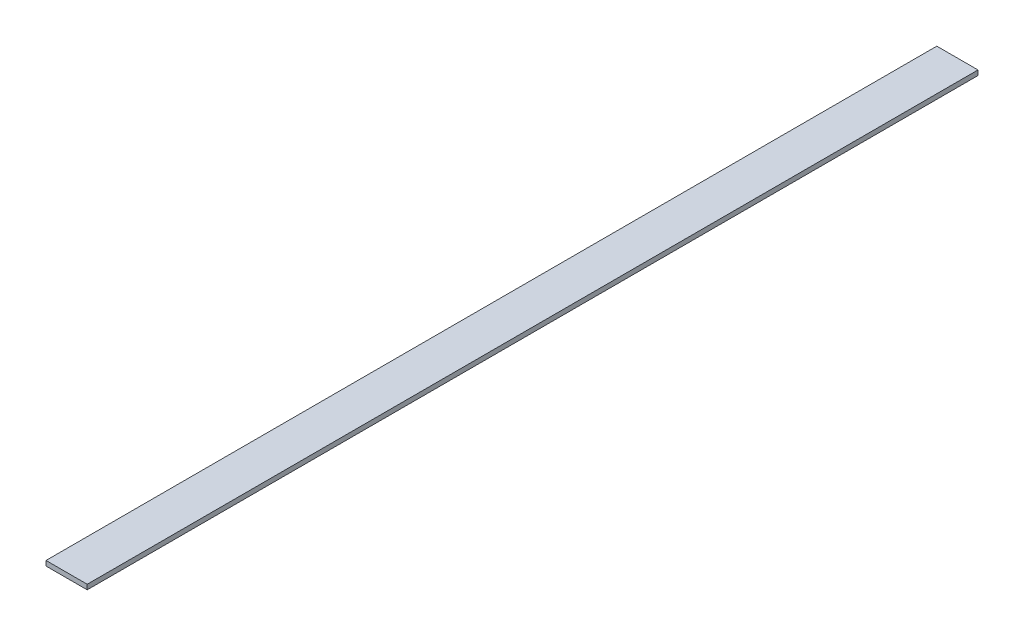
ISO-10303-21;
HEADER;
FILE_DESCRIPTION(('STEP AP214'),'2;1');
FILE_NAME('part.step','',(''),(''),'','','');
FILE_SCHEMA(('AUTOMOTIVE_DESIGN { 1 0 10303 214 1 1 1 1 }'));
ENDSEC;
DATA;
#1=APPLICATION_CONTEXT('core data for automotive mechanical design processes');
#2=APPLICATION_PROTOCOL_DEFINITION('international standard','automotive_design',2000,#1);
#3=PRODUCT_CONTEXT('',#1,'mechanical');
#4=PRODUCT('Part','Part','',(#3));
#5=PRODUCT_RELATED_PRODUCT_CATEGORY('part','',(#4));
#6=PRODUCT_DEFINITION_FORMATION('','',#4);
#7=PRODUCT_DEFINITION_CONTEXT('part definition',#1,'design');
#8=PRODUCT_DEFINITION('design','',#6,#7);
#9=PRODUCT_DEFINITION_SHAPE('','',#8);
#10=(LENGTH_UNIT() NAMED_UNIT(*) SI_UNIT(.MILLI.,.METRE.));
#11=(NAMED_UNIT(*) PLANE_ANGLE_UNIT() SI_UNIT($,.RADIAN.));
#12=(NAMED_UNIT(*) SI_UNIT($,.STERADIAN.) SOLID_ANGLE_UNIT());
#13=UNCERTAINTY_MEASURE_WITH_UNIT(LENGTH_MEASURE(1.E-05),#10,'distance_accuracy_value','');
#14=(GEOMETRIC_REPRESENTATION_CONTEXT(3) GLOBAL_UNCERTAINTY_ASSIGNED_CONTEXT((#13)) GLOBAL_UNIT_ASSIGNED_CONTEXT((#10,
#11,#12)) REPRESENTATION_CONTEXT('',''));
#15=CARTESIAN_POINT('',(0.,0.,0.));
#16=DIRECTION('',(0.,0.,1.));
#17=DIRECTION('',(1.,0.,0.));
#18=AXIS2_PLACEMENT_3D('',#15,#16,#17);
#19=CARTESIAN_POINT('',(-25.1001272406357,337.925662841851,503.882719675103));
#20=DIRECTION('',(-1.,0.,0.));
#21=DIRECTION('',(0.,0.,1.));
#22=AXIS2_PLACEMENT_3D('',#19,#20,#21);
#23=PLANE('',#22);
#24=DIRECTION('',(0.,0.,-1.));
#25=VECTOR('',#24,1.);
#26=CARTESIAN_POINT('',(-25.1001272406357,334.925662841851,503.882719675103));
#27=LINE('',#26,#25);
#28=CARTESIAN_POINT('',(-25.1001272406357,334.925662841851,503.882719675103));
#29=VERTEX_POINT('',#28);
#30=CARTESIAN_POINT('',(-25.1001272406357,334.925662841851,-45.3172803248968));
#31=VERTEX_POINT('',#30);
#32=EDGE_CURVE('E104',#29,#31,#27,.T.);
#33=ORIENTED_EDGE('',*,*,#32,.F.);
#34=DIRECTION('',(0.,-1.,0.));
#35=VECTOR('',#34,1.);
#36=CARTESIAN_POINT('',(-25.1001272406357,337.925662841851,503.882719675103));
#37=LINE('',#36,#35);
#38=CARTESIAN_POINT('',(-25.1001272406357,337.925662841851,503.882719675103));
#39=VERTEX_POINT('',#38);
#40=EDGE_CURVE('E11',#39,#29,#37,.T.);
#41=ORIENTED_EDGE('',*,*,#40,.F.);
#42=DIRECTION('',(0.,0.,-1.));
#43=VECTOR('',#42,1.);
#44=CARTESIAN_POINT('',(-25.1001272406357,337.925662841851,503.882719675103));
#45=LINE('',#44,#43);
#46=CARTESIAN_POINT('',(-25.1001272406357,337.925662841851,-45.3172803248968));
#47=VERTEX_POINT('',#46);
#48=EDGE_CURVE('E98',#39,#47,#45,.T.);
#49=ORIENTED_EDGE('',*,*,#48,.T.);
#50=DIRECTION('',(0.,-1.,0.));
#51=VECTOR('',#50,1.);
#52=CARTESIAN_POINT('',(-25.1001272406357,337.925662841851,-45.3172803248968));
#53=LINE('',#52,#51);
#54=EDGE_CURVE('E42',#47,#31,#53,.T.);
#55=ORIENTED_EDGE('',*,*,#54,.T.);
#56=EDGE_LOOP('',(#33,#41,#49,#55));
#57=FACE_BOUND('',#56,.T.);
#58=ADVANCED_FACE('F39',(#57),#23,.T.);
#59=CARTESIAN_POINT('',(-25.1001272406357,337.925662841851,503.882719675103));
#60=DIRECTION('',(0.,0.,-1.));
#61=DIRECTION('',(-1.,0.,0.));
#62=AXIS2_PLACEMENT_3D('',#59,#60,#61);
#63=PLANE('',#62);
#64=DIRECTION('',(1.,0.,0.));
#65=VECTOR('',#64,1.);
#66=CARTESIAN_POINT('',(-25.1001272406357,334.925662841851,503.882719675103));
#67=LINE('',#66,#65);
#68=CARTESIAN_POINT('',(0.299872759365239,334.925662841851,503.882719675103));
#69=VERTEX_POINT('',#68);
#70=EDGE_CURVE('E100',#29,#69,#67,.T.);
#71=ORIENTED_EDGE('',*,*,#70,.T.);
#72=DIRECTION('',(0.,-1.,0.));
#73=VECTOR('',#72,1.);
#74=CARTESIAN_POINT('',(0.299872759365239,337.925662841851,503.882719675103));
#75=LINE('',#74,#73);
#76=CARTESIAN_POINT('',(0.299872759365239,337.925662841851,503.882719675103));
#77=VERTEX_POINT('',#76);
#78=EDGE_CURVE('E48',#77,#69,#75,.T.);
#79=ORIENTED_EDGE('',*,*,#78,.F.);
#80=DIRECTION('',(1.,0.,0.));
#81=VECTOR('',#80,1.);
#82=CARTESIAN_POINT('',(-25.1001272406357,337.925662841851,503.882719675103));
#83=LINE('',#82,#81);
#84=EDGE_CURVE('E95',#39,#77,#83,.T.);
#85=ORIENTED_EDGE('',*,*,#84,.F.);
#86=ORIENTED_EDGE('',*,*,#40,.T.);
#87=EDGE_LOOP('',(#71,#79,#85,#86));
#88=FACE_BOUND('',#87,.T.);
#89=ADVANCED_FACE('F111',(#88),#63,.F.);
#90=CARTESIAN_POINT('',(0.299872759364018,337.925662841851,-45.3172803248968));
#91=DIRECTION('',(1.,0.,0.));
#92=DIRECTION('',(0.,0.,-1.));
#93=AXIS2_PLACEMENT_3D('',#90,#91,#92);
#94=PLANE('',#93);
#95=DIRECTION('',(0.,0.,1.));
#96=VECTOR('',#95,1.);
#97=CARTESIAN_POINT('',(0.299872759364018,334.925662841851,-45.3172803248968));
#98=LINE('',#97,#96);
#99=CARTESIAN_POINT('',(0.299872759364018,334.925662841851,-45.3172803248968));
#100=VERTEX_POINT('',#99);
#101=EDGE_CURVE('E89',#100,#69,#98,.T.);
#102=ORIENTED_EDGE('',*,*,#101,.F.);
#103=DIRECTION('',(0.,-1.,0.));
#104=VECTOR('',#103,1.);
#105=CARTESIAN_POINT('',(0.299872759364018,337.925662841851,-45.3172803248968));
#106=LINE('',#105,#104);
#107=CARTESIAN_POINT('',(0.299872759364018,337.925662841851,-45.3172803248968));
#108=VERTEX_POINT('',#107);
#109=EDGE_CURVE('E84',#108,#100,#106,.T.);
#110=ORIENTED_EDGE('',*,*,#109,.F.);
#111=DIRECTION('',(0.,0.,1.));
#112=VECTOR('',#111,1.);
#113=CARTESIAN_POINT('',(0.299872759364018,337.925662841851,-45.3172803248968));
#114=LINE('',#113,#112);
#115=EDGE_CURVE('E87',#108,#77,#114,.T.);
#116=ORIENTED_EDGE('',*,*,#115,.T.);
#117=ORIENTED_EDGE('',*,*,#78,.T.);
#118=EDGE_LOOP('',(#102,#110,#116,#117));
#119=FACE_BOUND('',#118,.T.);
#120=ADVANCED_FACE('F86',(#119),#94,.T.);
#121=CARTESIAN_POINT('',(-25.1001272406357,337.925662841851,-45.3172803248968));
#122=DIRECTION('',(0.,0.,-1.));
#123=DIRECTION('',(-1.,0.,0.));
#124=AXIS2_PLACEMENT_3D('',#121,#122,#123);
#125=PLANE('',#124);
#126=DIRECTION('',(1.,0.,0.));
#127=VECTOR('',#126,1.);
#128=CARTESIAN_POINT('',(-25.1001272406357,334.925662841851,-45.3172803248968));
#129=LINE('',#128,#127);
#130=EDGE_CURVE('E107',#31,#100,#129,.T.);
#131=ORIENTED_EDGE('',*,*,#130,.F.);
#132=ORIENTED_EDGE('',*,*,#54,.F.);
#133=DIRECTION('',(1.,0.,0.));
#134=VECTOR('',#133,1.);
#135=CARTESIAN_POINT('',(-25.1001272406357,337.925662841851,-45.3172803248968));
#136=LINE('',#135,#134);
#137=EDGE_CURVE('E94',#47,#108,#136,.T.);
#138=ORIENTED_EDGE('',*,*,#137,.T.);
#139=ORIENTED_EDGE('',*,*,#109,.T.);
#140=EDGE_LOOP('',(#131,#132,#138,#139));
#141=FACE_BOUND('',#140,.T.);
#142=ADVANCED_FACE('F97',(#141),#125,.T.);
#143=CARTESIAN_POINT('',(0.,337.925662841851,0.));
#144=DIRECTION('',(0.,-1.,0.));
#145=DIRECTION('',(0.,0.,-1.));
#146=AXIS2_PLACEMENT_3D('',#143,#144,#145);
#147=PLANE('',#146);
#148=ORIENTED_EDGE('',*,*,#48,.F.);
#149=ORIENTED_EDGE('',*,*,#84,.T.);
#150=ORIENTED_EDGE('',*,*,#115,.F.);
#151=ORIENTED_EDGE('',*,*,#137,.F.);
#152=EDGE_LOOP('',(#148,#149,#150,#151));
#153=FACE_BOUND('',#152,.T.);
#154=ADVANCED_FACE('F93',(#153),#147,.F.);
#155=CARTESIAN_POINT('',(0.,334.925662841851,0.));
#156=DIRECTION('',(0.,-1.,0.));
#157=DIRECTION('',(0.,0.,-1.));
#158=AXIS2_PLACEMENT_3D('',#155,#156,#157);
#159=PLANE('',#158);
#160=ORIENTED_EDGE('',*,*,#32,.T.);
#161=ORIENTED_EDGE('',*,*,#130,.T.);
#162=ORIENTED_EDGE('',*,*,#101,.T.);
#163=ORIENTED_EDGE('',*,*,#70,.F.);
#164=EDGE_LOOP('',(#160,#161,#162,#163));
#165=FACE_BOUND('',#164,.T.);
#166=ADVANCED_FACE('F113',(#165),#159,.T.);
#167=CLOSED_SHELL('',(#58,#89,#120,#142,#154,#166));
#168=MANIFOLD_SOLID_BREP('B2',#167);
#169=ADVANCED_BREP_SHAPE_REPRESENTATION('',(#18,#168),#14);
#170=SHAPE_DEFINITION_REPRESENTATION(#9,#169);
ENDSEC;
END-ISO-10303-21;
